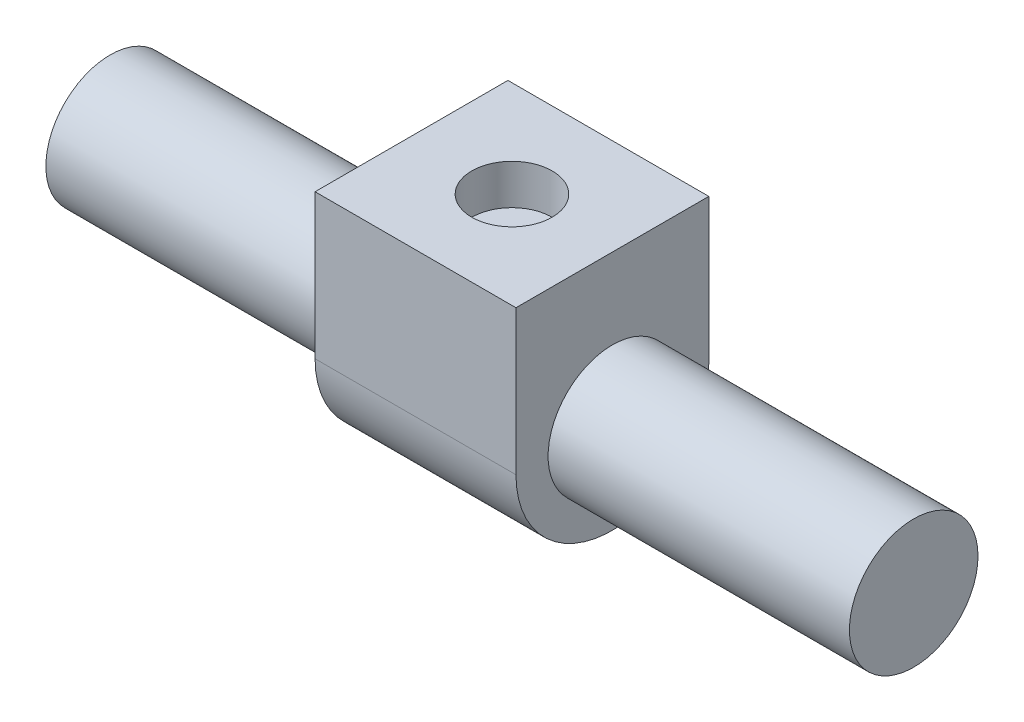
ISO-10303-21;
HEADER;
FILE_DESCRIPTION(('STEP AP214'),'2;1');
FILE_NAME('part.step','',(''),(''),'','','');
FILE_SCHEMA(('AUTOMOTIVE_DESIGN { 1 0 10303 214 1 1 1 1 }'));
ENDSEC;
DATA;
#1=APPLICATION_CONTEXT('core data for automotive mechanical design processes');
#2=APPLICATION_PROTOCOL_DEFINITION('international standard','automotive_design',2000,#1);
#3=PRODUCT_CONTEXT('',#1,'mechanical');
#4=PRODUCT('Part','Part','',(#3));
#5=PRODUCT_RELATED_PRODUCT_CATEGORY('part','',(#4));
#6=PRODUCT_DEFINITION_FORMATION('','',#4);
#7=PRODUCT_DEFINITION_CONTEXT('part definition',#1,'design');
#8=PRODUCT_DEFINITION('design','',#6,#7);
#9=PRODUCT_DEFINITION_SHAPE('','',#8);
#10=(LENGTH_UNIT() NAMED_UNIT(*) SI_UNIT(.MILLI.,.METRE.));
#11=(NAMED_UNIT(*) PLANE_ANGLE_UNIT() SI_UNIT($,.RADIAN.));
#12=(NAMED_UNIT(*) SI_UNIT($,.STERADIAN.) SOLID_ANGLE_UNIT());
#13=UNCERTAINTY_MEASURE_WITH_UNIT(LENGTH_MEASURE(1.E-05),#10,'distance_accuracy_value','');
#14=(GEOMETRIC_REPRESENTATION_CONTEXT(3) GLOBAL_UNCERTAINTY_ASSIGNED_CONTEXT((#13)) GLOBAL_UNIT_ASSIGNED_CONTEXT((#10,
#11,#12)) REPRESENTATION_CONTEXT('',''));
#15=CARTESIAN_POINT('',(0.,0.,0.));
#16=DIRECTION('',(0.,0.,1.));
#17=DIRECTION('',(1.,0.,0.));
#18=AXIS2_PLACEMENT_3D('',#15,#16,#17);
#19=CARTESIAN_POINT('',(12.5,0.,0.));
#20=DIRECTION('',(1.,0.,0.));
#21=DIRECTION('',(0.,0.,-1.));
#22=AXIS2_PLACEMENT_3D('',#19,#20,#21);
#23=PLANE('',#22);
#24=CARTESIAN_POINT('',(12.5,0.,0.));
#25=DIRECTION('',(1.,0.,0.));
#26=DIRECTION('',(0.,0.,-1.));
#27=AXIS2_PLACEMENT_3D('',#24,#25,#26);
#28=CIRCLE('',#27,12.);
#29=CARTESIAN_POINT('',(12.5,0.,12.));
#30=VERTEX_POINT('',#29);
#31=CARTESIAN_POINT('',(12.5,0.,-12.));
#32=VERTEX_POINT('',#31);
#33=EDGE_CURVE('E85',#30,#32,#28,.T.);
#34=ORIENTED_EDGE('',*,*,#33,.T.);
#35=DIRECTION('',(0.,1.,0.));
#36=VECTOR('',#35,1.);
#37=CARTESIAN_POINT('',(12.5,0.,-12.));
#38=LINE('',#37,#36);
#39=CARTESIAN_POINT('',(12.5,18.,-12.));
#40=VERTEX_POINT('',#39);
#41=EDGE_CURVE('E80',#32,#40,#38,.T.);
#42=ORIENTED_EDGE('',*,*,#41,.T.);
#43=DIRECTION('',(0.,0.,1.));
#44=VECTOR('',#43,1.);
#45=CARTESIAN_POINT('',(12.5,18.,12.));
#46=LINE('',#45,#44);
#47=CARTESIAN_POINT('',(12.5,18.,12.));
#48=VERTEX_POINT('',#47);
#49=EDGE_CURVE('E83',#40,#48,#46,.T.);
#50=ORIENTED_EDGE('',*,*,#49,.T.);
#51=DIRECTION('',(0.,-1.,0.));
#52=VECTOR('',#51,1.);
#53=CARTESIAN_POINT('',(12.5,0.,12.));
#54=LINE('',#53,#52);
#55=EDGE_CURVE('E49',#48,#30,#54,.T.);
#56=ORIENTED_EDGE('',*,*,#55,.T.);
#57=EDGE_LOOP('',(#34,#42,#50,#56));
#58=FACE_BOUND('',#57,.T.);
#59=CARTESIAN_POINT('',(12.5,0.,0.));
#60=DIRECTION('',(1.,0.,0.));
#61=DIRECTION('',(0.,0.,-1.));
#62=AXIS2_PLACEMENT_3D('',#59,#60,#61);
#63=CIRCLE('',#62,8.);
#64=CARTESIAN_POINT('',(12.5,0.,-8.));
#65=VERTEX_POINT('',#64);
#66=EDGE_CURVE('E102',#65,#65,#63,.F.);
#67=ORIENTED_EDGE('',*,*,#66,.T.);
#68=EDGE_LOOP('',(#67));
#69=FACE_BOUND('',#68,.T.);
#70=ADVANCED_FACE('F32',(#58,#69),#23,.T.);
#71=CARTESIAN_POINT('',(-12.5,0.,0.));
#72=DIRECTION('',(1.,0.,0.));
#73=DIRECTION('',(0.,0.,-1.));
#74=AXIS2_PLACEMENT_3D('',#71,#72,#73);
#75=PLANE('',#74);
#76=CARTESIAN_POINT('',(-12.5,0.,0.));
#77=DIRECTION('',(1.,0.,0.));
#78=DIRECTION('',(0.,0.,-1.));
#79=AXIS2_PLACEMENT_3D('',#76,#77,#78);
#80=CIRCLE('',#79,12.);
#81=CARTESIAN_POINT('',(-12.5,0.,12.));
#82=VERTEX_POINT('',#81);
#83=CARTESIAN_POINT('',(-12.5,0.,-12.));
#84=VERTEX_POINT('',#83);
#85=EDGE_CURVE('E99',#82,#84,#80,.T.);
#86=ORIENTED_EDGE('',*,*,#85,.F.);
#87=DIRECTION('',(0.,-1.,0.));
#88=VECTOR('',#87,1.);
#89=CARTESIAN_POINT('',(-12.5,0.,12.));
#90=LINE('',#89,#88);
#91=CARTESIAN_POINT('',(-12.5,18.,12.));
#92=VERTEX_POINT('',#91);
#93=EDGE_CURVE('E72',#92,#82,#90,.T.);
#94=ORIENTED_EDGE('',*,*,#93,.F.);
#95=DIRECTION('',(0.,0.,1.));
#96=VECTOR('',#95,1.);
#97=CARTESIAN_POINT('',(-12.5,18.,12.));
#98=LINE('',#97,#96);
#99=CARTESIAN_POINT('',(-12.5,18.,-12.));
#100=VERTEX_POINT('',#99);
#101=EDGE_CURVE('E66',#100,#92,#98,.T.);
#102=ORIENTED_EDGE('',*,*,#101,.F.);
#103=DIRECTION('',(0.,1.,0.));
#104=VECTOR('',#103,1.);
#105=CARTESIAN_POINT('',(-12.5,0.,-12.));
#106=LINE('',#105,#104);
#107=EDGE_CURVE('E90',#84,#100,#106,.T.);
#108=ORIENTED_EDGE('',*,*,#107,.F.);
#109=EDGE_LOOP('',(#86,#94,#102,#108));
#110=FACE_BOUND('',#109,.T.);
#111=CARTESIAN_POINT('',(-12.5,0.,0.));
#112=DIRECTION('',(1.,0.,0.));
#113=DIRECTION('',(0.,0.,-1.));
#114=AXIS2_PLACEMENT_3D('',#111,#112,#113);
#115=CIRCLE('',#114,8.);
#116=CARTESIAN_POINT('',(-12.5,0.,-8.));
#117=VERTEX_POINT('',#116);
#118=EDGE_CURVE('E11',#117,#117,#115,.F.);
#119=ORIENTED_EDGE('',*,*,#118,.F.);
#120=EDGE_LOOP('',(#119));
#121=FACE_BOUND('',#120,.T.);
#122=ADVANCED_FACE('F110',(#110,#121),#75,.F.);
#123=CARTESIAN_POINT('',(12.5,0.,0.));
#124=DIRECTION('',(-1.,0.,0.));
#125=DIRECTION('',(0.,0.,1.));
#126=AXIS2_PLACEMENT_3D('',#123,#124,#125);
#127=CYLINDRICAL_SURFACE('',#126,12.);
#128=ORIENTED_EDGE('',*,*,#85,.T.);
#129=DIRECTION('',(-1.,0.,0.));
#130=VECTOR('',#129,1.);
#131=CARTESIAN_POINT('',(12.5,0.,-12.));
#132=LINE('',#131,#130);
#133=EDGE_CURVE('E41',#32,#84,#132,.T.);
#134=ORIENTED_EDGE('',*,*,#133,.F.);
#135=ORIENTED_EDGE('',*,*,#33,.F.);
#136=DIRECTION('',(-1.,0.,0.));
#137=VECTOR('',#136,1.);
#138=CARTESIAN_POINT('',(12.5,0.,12.));
#139=LINE('',#138,#137);
#140=EDGE_CURVE('E95',#30,#82,#139,.T.);
#141=ORIENTED_EDGE('',*,*,#140,.T.);
#142=EDGE_LOOP('',(#128,#134,#135,#141));
#143=FACE_BOUND('',#142,.T.);
#144=ADVANCED_FACE('F34',(#143),#127,.T.);
#145=CARTESIAN_POINT('',(12.5,0.,-12.));
#146=DIRECTION('',(0.,0.,1.));
#147=DIRECTION('',(1.,0.,0.));
#148=AXIS2_PLACEMENT_3D('',#145,#146,#147);
#149=PLANE('',#148);
#150=ORIENTED_EDGE('',*,*,#107,.T.);
#151=DIRECTION('',(-1.,0.,0.));
#152=VECTOR('',#151,1.);
#153=CARTESIAN_POINT('',(12.5,18.,-12.));
#154=LINE('',#153,#152);
#155=EDGE_CURVE('E88',#40,#100,#154,.T.);
#156=ORIENTED_EDGE('',*,*,#155,.F.);
#157=ORIENTED_EDGE('',*,*,#41,.F.);
#158=ORIENTED_EDGE('',*,*,#133,.T.);
#159=EDGE_LOOP('',(#150,#156,#157,#158));
#160=FACE_BOUND('',#159,.T.);
#161=ADVANCED_FACE('F89',(#160),#149,.F.);
#162=CARTESIAN_POINT('',(12.5,18.,12.));
#163=DIRECTION('',(0.,-1.,0.));
#164=DIRECTION('',(0.,0.,-1.));
#165=AXIS2_PLACEMENT_3D('',#162,#163,#164);
#166=PLANE('',#165);
#167=CARTESIAN_POINT('',(0.,18.,0.));
#168=DIRECTION('',(0.,1.,0.));
#169=DIRECTION('',(0.,0.,1.));
#170=AXIS2_PLACEMENT_3D('',#167,#168,#169);
#171=CIRCLE('',#170,5.);
#172=CARTESIAN_POINT('',(0.,18.,5.));
#173=VERTEX_POINT('',#172);
#174=EDGE_CURVE('E215',#173,#173,#171,.T.);
#175=ORIENTED_EDGE('',*,*,#174,.F.);
#176=EDGE_LOOP('',(#175));
#177=FACE_BOUND('',#176,.T.);
#178=ORIENTED_EDGE('',*,*,#101,.T.);
#179=DIRECTION('',(-1.,0.,0.));
#180=VECTOR('',#179,1.);
#181=CARTESIAN_POINT('',(12.5,18.,12.));
#182=LINE('',#181,#180);
#183=EDGE_CURVE('E91',#48,#92,#182,.T.);
#184=ORIENTED_EDGE('',*,*,#183,.F.);
#185=ORIENTED_EDGE('',*,*,#49,.F.);
#186=ORIENTED_EDGE('',*,*,#155,.T.);
#187=EDGE_LOOP('',(#178,#184,#185,#186));
#188=FACE_BOUND('',#187,.T.);
#189=ADVANCED_FACE('F93',(#177,#188),#166,.F.);
#190=CARTESIAN_POINT('',(12.5,0.,12.));
#191=DIRECTION('',(0.,0.,-1.));
#192=DIRECTION('',(0.,1.,0.));
#193=AXIS2_PLACEMENT_3D('',#190,#191,#192);
#194=PLANE('',#193);
#195=ORIENTED_EDGE('',*,*,#93,.T.);
#196=ORIENTED_EDGE('',*,*,#140,.F.);
#197=ORIENTED_EDGE('',*,*,#55,.F.);
#198=ORIENTED_EDGE('',*,*,#183,.T.);
#199=EDGE_LOOP('',(#195,#196,#197,#198));
#200=FACE_BOUND('',#199,.T.);
#201=ADVANCED_FACE('F128',(#200),#194,.F.);
#202=CARTESIAN_POINT('',(-50.,0.,0.));
#203=DIRECTION('',(1.,0.,0.));
#204=DIRECTION('',(0.,0.,-1.));
#205=AXIS2_PLACEMENT_3D('',#202,#203,#204);
#206=PLANE('',#205);
#207=CARTESIAN_POINT('',(-50.,0.,0.));
#208=DIRECTION('',(1.,0.,0.));
#209=DIRECTION('',(0.,0.,-1.));
#210=AXIS2_PLACEMENT_3D('',#207,#208,#209);
#211=CIRCLE('',#210,8.);
#212=CARTESIAN_POINT('',(-50.,0.,-8.));
#213=VERTEX_POINT('',#212);
#214=EDGE_CURVE('E214',#213,#213,#211,.T.);
#215=ORIENTED_EDGE('',*,*,#214,.F.);
#216=EDGE_LOOP('',(#215));
#217=FACE_BOUND('',#216,.T.);
#218=ADVANCED_FACE('F119',(#217),#206,.F.);
#219=CARTESIAN_POINT('',(50.,0.,0.));
#220=DIRECTION('',(-1.,0.,0.));
#221=DIRECTION('',(0.,0.,1.));
#222=AXIS2_PLACEMENT_3D('',#219,#220,#221);
#223=CYLINDRICAL_SURFACE('',#222,8.);
#224=ORIENTED_EDGE('',*,*,#214,.T.);
#225=EDGE_LOOP('',(#224));
#226=FACE_BOUND('',#225,.T.);
#227=ORIENTED_EDGE('',*,*,#118,.T.);
#228=EDGE_LOOP('',(#227));
#229=FACE_BOUND('',#228,.T.);
#230=ADVANCED_FACE('F116',(#226,#229),#223,.T.);
#231=ORIENTED_EDGE('',*,*,#66,.F.);
#232=EDGE_LOOP('',(#231));
#233=FACE_BOUND('',#232,.T.);
#234=CARTESIAN_POINT('',(50.,0.,0.));
#235=DIRECTION('',(1.,0.,0.));
#236=DIRECTION('',(0.,0.,-1.));
#237=AXIS2_PLACEMENT_3D('',#234,#235,#236);
#238=CIRCLE('',#237,8.);
#239=CARTESIAN_POINT('',(50.,0.,-8.));
#240=VERTEX_POINT('',#239);
#241=EDGE_CURVE('E217',#240,#240,#238,.T.);
#242=ORIENTED_EDGE('',*,*,#241,.F.);
#243=EDGE_LOOP('',(#242));
#244=FACE_BOUND('',#243,.T.);
#245=ADVANCED_FACE('F118',(#233,#244),#223,.T.);
#246=CARTESIAN_POINT('',(50.,0.,0.));
#247=DIRECTION('',(1.,0.,0.));
#248=DIRECTION('',(0.,0.,-1.));
#249=AXIS2_PLACEMENT_3D('',#246,#247,#248);
#250=PLANE('',#249);
#251=ORIENTED_EDGE('',*,*,#241,.T.);
#252=EDGE_LOOP('',(#251));
#253=FACE_BOUND('',#252,.T.);
#254=ADVANCED_FACE('F126',(#253),#250,.T.);
#255=CARTESIAN_POINT('',(0.,13.,0.));
#256=DIRECTION('',(0.,1.,0.));
#257=DIRECTION('',(0.,0.,1.));
#258=AXIS2_PLACEMENT_3D('',#255,#256,#257);
#259=CYLINDRICAL_SURFACE('',#258,5.);
#260=CARTESIAN_POINT('',(0.,13.,0.));
#261=DIRECTION('',(0.,1.,0.));
#262=DIRECTION('',(0.,0.,1.));
#263=AXIS2_PLACEMENT_3D('',#260,#261,#262);
#264=CIRCLE('',#263,5.);
#265=CARTESIAN_POINT('',(0.,13.,5.));
#266=VERTEX_POINT('',#265);
#267=EDGE_CURVE('E213',#266,#266,#264,.T.);
#268=ORIENTED_EDGE('',*,*,#267,.F.);
#269=EDGE_LOOP('',(#268));
#270=FACE_BOUND('',#269,.T.);
#271=ORIENTED_EDGE('',*,*,#174,.T.);
#272=EDGE_LOOP('',(#271));
#273=FACE_BOUND('',#272,.T.);
#274=ADVANCED_FACE('F180',(#270,#273),#259,.F.);
#275=CARTESIAN_POINT('',(0.,13.,0.));
#276=DIRECTION('',(0.,1.,0.));
#277=DIRECTION('',(0.,0.,1.));
#278=AXIS2_PLACEMENT_3D('',#275,#276,#277);
#279=PLANE('',#278);
#280=ORIENTED_EDGE('',*,*,#267,.T.);
#281=EDGE_LOOP('',(#280));
#282=FACE_BOUND('',#281,.T.);
#283=ADVANCED_FACE('F197',(#282),#279,.T.);
#284=CLOSED_SHELL('',(#70,#122,#144,#161,#189,#201,#218,#230,#245,#254,#274,#283));
#285=MANIFOLD_SOLID_BREP('B2',#284);
#286=ADVANCED_BREP_SHAPE_REPRESENTATION('',(#18,#285),#14);
#287=SHAPE_DEFINITION_REPRESENTATION(#9,#286);
ENDSEC;
END-ISO-10303-21;
